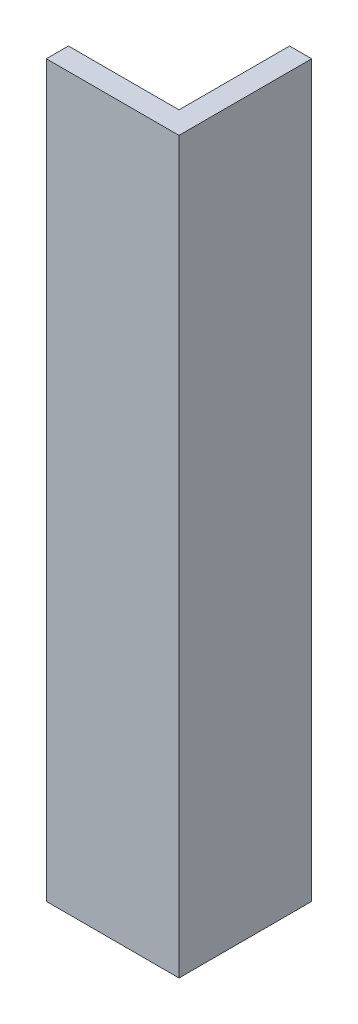
ISO-10303-21;
HEADER;
FILE_DESCRIPTION(('STEP AP214'),'2;1');
FILE_NAME('part.step','',(''),(''),'','','');
FILE_SCHEMA(('AUTOMOTIVE_DESIGN { 1 0 10303 214 1 1 1 1 }'));
ENDSEC;
DATA;
#1=APPLICATION_CONTEXT('core data for automotive mechanical design processes');
#2=APPLICATION_PROTOCOL_DEFINITION('international standard','automotive_design',2000,#1);
#3=PRODUCT_CONTEXT('',#1,'mechanical');
#4=PRODUCT('Part','Part','',(#3));
#5=PRODUCT_RELATED_PRODUCT_CATEGORY('part','',(#4));
#6=PRODUCT_DEFINITION_FORMATION('','',#4);
#7=PRODUCT_DEFINITION_CONTEXT('part definition',#1,'design');
#8=PRODUCT_DEFINITION('design','',#6,#7);
#9=PRODUCT_DEFINITION_SHAPE('','',#8);
#10=(LENGTH_UNIT() NAMED_UNIT(*) SI_UNIT(.MILLI.,.METRE.));
#11=(NAMED_UNIT(*) PLANE_ANGLE_UNIT() SI_UNIT($,.RADIAN.));
#12=(NAMED_UNIT(*) SI_UNIT($,.STERADIAN.) SOLID_ANGLE_UNIT());
#13=UNCERTAINTY_MEASURE_WITH_UNIT(LENGTH_MEASURE(1.E-05),#10,'distance_accuracy_value','');
#14=(GEOMETRIC_REPRESENTATION_CONTEXT(3) GLOBAL_UNCERTAINTY_ASSIGNED_CONTEXT((#13)) GLOBAL_UNIT_ASSIGNED_CONTEXT((#10,
#11,#12)) REPRESENTATION_CONTEXT('',''));
#15=CARTESIAN_POINT('',(0.,0.,0.));
#16=DIRECTION('',(0.,0.,1.));
#17=DIRECTION('',(1.,0.,0.));
#18=AXIS2_PLACEMENT_3D('',#15,#16,#17);
#19=CARTESIAN_POINT('',(12.7,83.82,0.));
#20=DIRECTION('',(-1.,0.,0.));
#21=DIRECTION('',(0.,0.,1.));
#22=AXIS2_PLACEMENT_3D('',#19,#20,#21);
#23=PLANE('',#22);
#24=DIRECTION('',(0.,0.,-1.));
#25=VECTOR('',#24,1.);
#26=CARTESIAN_POINT('',(12.7,0.,0.));
#27=LINE('',#26,#25);
#28=CARTESIAN_POINT('',(12.7,0.,-2.54));
#29=VERTEX_POINT('',#28);
#30=CARTESIAN_POINT('',(12.7,0.,-15.24));
#31=VERTEX_POINT('',#30);
#32=EDGE_CURVE('E116',#29,#31,#27,.T.);
#33=ORIENTED_EDGE('',*,*,#32,.F.);
#34=DIRECTION('',(0.,-1.,0.));
#35=VECTOR('',#34,1.);
#36=CARTESIAN_POINT('',(12.7,83.82,-2.54));
#37=LINE('',#36,#35);
#38=CARTESIAN_POINT('',(12.7,83.82,-2.54));
#39=VERTEX_POINT('',#38);
#40=EDGE_CURVE('E11',#39,#29,#37,.T.);
#41=ORIENTED_EDGE('',*,*,#40,.F.);
#42=DIRECTION('',(0.,0.,-1.));
#43=VECTOR('',#42,1.);
#44=CARTESIAN_POINT('',(12.7,83.82,0.));
#45=LINE('',#44,#43);
#46=CARTESIAN_POINT('',(12.7,83.82,-15.24));
#47=VERTEX_POINT('',#46);
#48=EDGE_CURVE('E129',#39,#47,#45,.T.);
#49=ORIENTED_EDGE('',*,*,#48,.T.);
#50=DIRECTION('',(0.,-1.,0.));
#51=VECTOR('',#50,1.);
#52=CARTESIAN_POINT('',(12.7,83.82,-15.24));
#53=LINE('',#52,#51);
#54=EDGE_CURVE('E81',#47,#31,#53,.T.);
#55=ORIENTED_EDGE('',*,*,#54,.T.);
#56=EDGE_LOOP('',(#33,#41,#49,#55));
#57=FACE_BOUND('',#56,.T.);
#58=ADVANCED_FACE('F36',(#57),#23,.T.);
#59=CARTESIAN_POINT('',(0.,83.82,-2.54));
#60=DIRECTION('',(0.,0.,-1.));
#61=DIRECTION('',(-1.,0.,0.));
#62=AXIS2_PLACEMENT_3D('',#59,#60,#61);
#63=PLANE('',#62);
#64=DIRECTION('',(1.,0.,0.));
#65=VECTOR('',#64,1.);
#66=CARTESIAN_POINT('',(0.,0.,-2.54));
#67=LINE('',#66,#65);
#68=CARTESIAN_POINT('',(0.,0.,-2.54));
#69=VERTEX_POINT('',#68);
#70=EDGE_CURVE('E119',#69,#29,#67,.T.);
#71=ORIENTED_EDGE('',*,*,#70,.F.);
#72=DIRECTION('',(0.,-1.,0.));
#73=VECTOR('',#72,1.);
#74=CARTESIAN_POINT('',(0.,83.82,-2.54));
#75=LINE('',#74,#73);
#76=CARTESIAN_POINT('',(0.,83.82,-2.54));
#77=VERTEX_POINT('',#76);
#78=EDGE_CURVE('E44',#77,#69,#75,.T.);
#79=ORIENTED_EDGE('',*,*,#78,.F.);
#80=DIRECTION('',(1.,0.,0.));
#81=VECTOR('',#80,1.);
#82=CARTESIAN_POINT('',(0.,83.82,-2.54));
#83=LINE('',#82,#81);
#84=EDGE_CURVE('E144',#77,#39,#83,.T.);
#85=ORIENTED_EDGE('',*,*,#84,.T.);
#86=ORIENTED_EDGE('',*,*,#40,.T.);
#87=EDGE_LOOP('',(#71,#79,#85,#86));
#88=FACE_BOUND('',#87,.T.);
#89=ADVANCED_FACE('F138',(#88),#63,.T.);
#90=CARTESIAN_POINT('',(0.,83.82,0.));
#91=DIRECTION('',(-1.,0.,0.));
#92=DIRECTION('',(0.,0.,1.));
#93=AXIS2_PLACEMENT_3D('',#90,#91,#92);
#94=PLANE('',#93);
#95=DIRECTION('',(0.,0.,-1.));
#96=VECTOR('',#95,1.);
#97=CARTESIAN_POINT('',(0.,0.,0.));
#98=LINE('',#97,#96);
#99=CARTESIAN_POINT('',(0.,0.,0.));
#100=VERTEX_POINT('',#99);
#101=EDGE_CURVE('E122',#100,#69,#98,.T.);
#102=ORIENTED_EDGE('',*,*,#101,.F.);
#103=DIRECTION('',(0.,-1.,0.));
#104=VECTOR('',#103,1.);
#105=CARTESIAN_POINT('',(0.,83.82,0.));
#106=LINE('',#105,#104);
#107=CARTESIAN_POINT('',(0.,83.82,0.));
#108=VERTEX_POINT('',#107);
#109=EDGE_CURVE('E108',#108,#100,#106,.T.);
#110=ORIENTED_EDGE('',*,*,#109,.F.);
#111=DIRECTION('',(0.,0.,-1.));
#112=VECTOR('',#111,1.);
#113=CARTESIAN_POINT('',(0.,83.82,0.));
#114=LINE('',#113,#112);
#115=EDGE_CURVE('E101',#108,#77,#114,.T.);
#116=ORIENTED_EDGE('',*,*,#115,.T.);
#117=ORIENTED_EDGE('',*,*,#78,.T.);
#118=EDGE_LOOP('',(#102,#110,#116,#117));
#119=FACE_BOUND('',#118,.T.);
#120=ADVANCED_FACE('F135',(#119),#94,.T.);
#121=CARTESIAN_POINT('',(0.,83.82,0.));
#122=DIRECTION('',(0.,0.,-1.));
#123=DIRECTION('',(-1.,0.,0.));
#124=AXIS2_PLACEMENT_3D('',#121,#122,#123);
#125=PLANE('',#124);
#126=DIRECTION('',(1.,0.,0.));
#127=VECTOR('',#126,1.);
#128=CARTESIAN_POINT('',(0.,0.,0.));
#129=LINE('',#128,#127);
#130=CARTESIAN_POINT('',(15.24,0.,0.));
#131=VERTEX_POINT('',#130);
#132=EDGE_CURVE('E107',#100,#131,#129,.T.);
#133=ORIENTED_EDGE('',*,*,#132,.T.);
#134=DIRECTION('',(0.,-1.,0.));
#135=VECTOR('',#134,1.);
#136=CARTESIAN_POINT('',(15.24,83.82,0.));
#137=LINE('',#136,#135);
#138=CARTESIAN_POINT('',(15.24,83.82,0.));
#139=VERTEX_POINT('',#138);
#140=EDGE_CURVE('E104',#139,#131,#137,.T.);
#141=ORIENTED_EDGE('',*,*,#140,.F.);
#142=DIRECTION('',(1.,0.,0.));
#143=VECTOR('',#142,1.);
#144=CARTESIAN_POINT('',(0.,83.82,0.));
#145=LINE('',#144,#143);
#146=EDGE_CURVE('E94',#108,#139,#145,.T.);
#147=ORIENTED_EDGE('',*,*,#146,.F.);
#148=ORIENTED_EDGE('',*,*,#109,.T.);
#149=EDGE_LOOP('',(#133,#141,#147,#148));
#150=FACE_BOUND('',#149,.T.);
#151=ADVANCED_FACE('F105',(#150),#125,.F.);
#152=CARTESIAN_POINT('',(15.24,83.82,0.));
#153=DIRECTION('',(-1.,0.,0.));
#154=DIRECTION('',(0.,0.,1.));
#155=AXIS2_PLACEMENT_3D('',#152,#153,#154);
#156=PLANE('',#155);
#157=DIRECTION('',(0.,0.,-1.));
#158=VECTOR('',#157,1.);
#159=CARTESIAN_POINT('',(15.24,0.,0.));
#160=LINE('',#159,#158);
#161=CARTESIAN_POINT('',(15.24,0.,-15.24));
#162=VERTEX_POINT('',#161);
#163=EDGE_CURVE('E74',#131,#162,#160,.T.);
#164=ORIENTED_EDGE('',*,*,#163,.T.);
#165=DIRECTION('',(0.,-1.,0.));
#166=VECTOR('',#165,1.);
#167=CARTESIAN_POINT('',(15.24,83.82,-15.24));
#168=LINE('',#167,#166);
#169=CARTESIAN_POINT('',(15.24,83.82,-15.24));
#170=VERTEX_POINT('',#169);
#171=EDGE_CURVE('E109',#170,#162,#168,.T.);
#172=ORIENTED_EDGE('',*,*,#171,.F.);
#173=DIRECTION('',(0.,0.,-1.));
#174=VECTOR('',#173,1.);
#175=CARTESIAN_POINT('',(15.24,83.82,0.));
#176=LINE('',#175,#174);
#177=EDGE_CURVE('E98',#139,#170,#176,.T.);
#178=ORIENTED_EDGE('',*,*,#177,.F.);
#179=ORIENTED_EDGE('',*,*,#140,.T.);
#180=EDGE_LOOP('',(#164,#172,#178,#179));
#181=FACE_BOUND('',#180,.T.);
#182=ADVANCED_FACE('F111',(#181),#156,.F.);
#183=CARTESIAN_POINT('',(0.,83.82,-15.24));
#184=DIRECTION('',(0.,0.,1.));
#185=DIRECTION('',(1.,0.,0.));
#186=AXIS2_PLACEMENT_3D('',#183,#184,#185);
#187=PLANE('',#186);
#188=DIRECTION('',(-1.,0.,0.));
#189=VECTOR('',#188,1.);
#190=CARTESIAN_POINT('',(0.,0.,-15.24));
#191=LINE('',#190,#189);
#192=EDGE_CURVE('E127',#162,#31,#191,.T.);
#193=ORIENTED_EDGE('',*,*,#192,.T.);
#194=ORIENTED_EDGE('',*,*,#54,.F.);
#195=DIRECTION('',(-1.,0.,0.));
#196=VECTOR('',#195,1.);
#197=CARTESIAN_POINT('',(0.,83.82,-15.24));
#198=LINE('',#197,#196);
#199=EDGE_CURVE('E52',#170,#47,#198,.T.);
#200=ORIENTED_EDGE('',*,*,#199,.F.);
#201=ORIENTED_EDGE('',*,*,#171,.T.);
#202=EDGE_LOOP('',(#193,#194,#200,#201));
#203=FACE_BOUND('',#202,.T.);
#204=ADVANCED_FACE('F143',(#203),#187,.F.);
#205=CARTESIAN_POINT('',(0.,83.82,0.));
#206=DIRECTION('',(0.,1.,0.));
#207=DIRECTION('',(0.,0.,1.));
#208=AXIS2_PLACEMENT_3D('',#205,#206,#207);
#209=PLANE('',#208);
#210=ORIENTED_EDGE('',*,*,#48,.F.);
#211=ORIENTED_EDGE('',*,*,#84,.F.);
#212=ORIENTED_EDGE('',*,*,#115,.F.);
#213=ORIENTED_EDGE('',*,*,#146,.T.);
#214=ORIENTED_EDGE('',*,*,#177,.T.);
#215=ORIENTED_EDGE('',*,*,#199,.T.);
#216=EDGE_LOOP('',(#210,#211,#212,#213,#214,#215));
#217=FACE_BOUND('',#216,.T.);
#218=ADVANCED_FACE('F96',(#217),#209,.T.);
#219=CARTESIAN_POINT('',(0.,0.,0.));
#220=DIRECTION('',(0.,1.,0.));
#221=DIRECTION('',(0.,0.,1.));
#222=AXIS2_PLACEMENT_3D('',#219,#220,#221);
#223=PLANE('',#222);
#224=ORIENTED_EDGE('',*,*,#32,.T.);
#225=ORIENTED_EDGE('',*,*,#192,.F.);
#226=ORIENTED_EDGE('',*,*,#163,.F.);
#227=ORIENTED_EDGE('',*,*,#132,.F.);
#228=ORIENTED_EDGE('',*,*,#101,.T.);
#229=ORIENTED_EDGE('',*,*,#70,.T.);
#230=EDGE_LOOP('',(#224,#225,#226,#227,#228,#229));
#231=FACE_BOUND('',#230,.T.);
#232=ADVANCED_FACE('F140',(#231),#223,.F.);
#233=CLOSED_SHELL('',(#58,#89,#120,#151,#182,#204,#218,#232));
#234=MANIFOLD_SOLID_BREP('B2',#233);
#235=ADVANCED_BREP_SHAPE_REPRESENTATION('',(#18,#234),#14);
#236=SHAPE_DEFINITION_REPRESENTATION(#9,#235);
ENDSEC;
END-ISO-10303-21;
